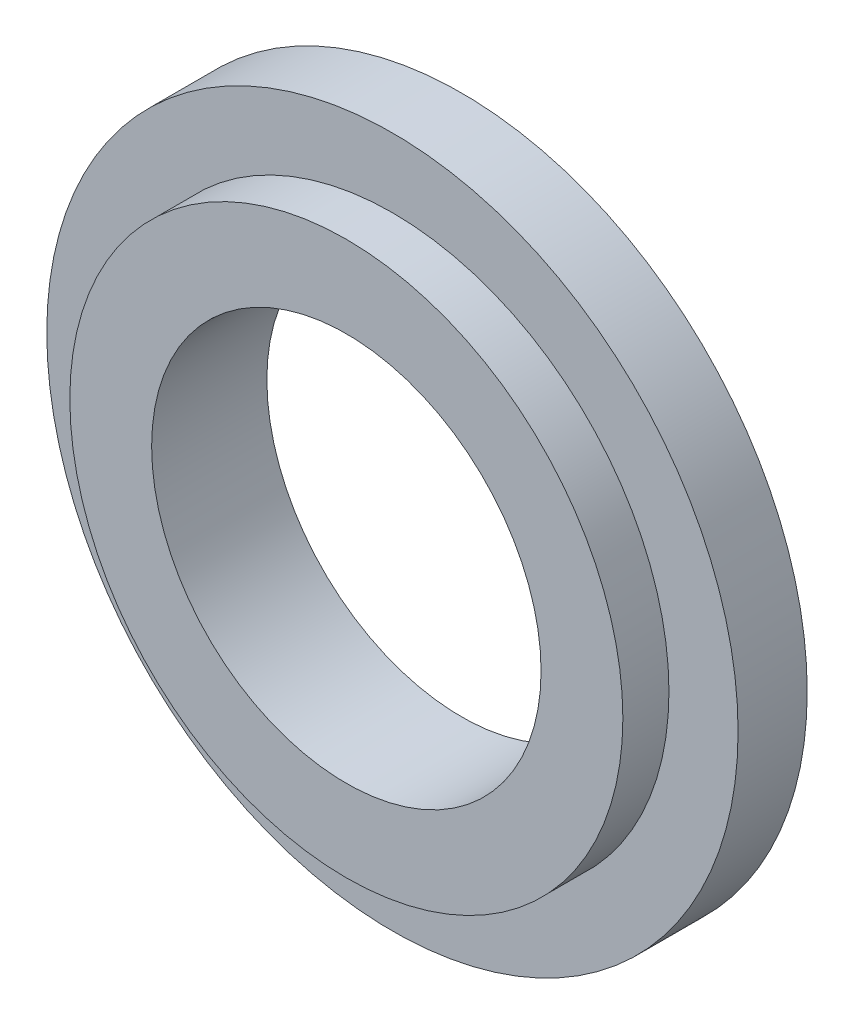
ISO-10303-21;
HEADER;
FILE_DESCRIPTION(('STEP AP214'),'2;1');
FILE_NAME('part.step','',(''),(''),'','','');
FILE_SCHEMA(('AUTOMOTIVE_DESIGN { 1 0 10303 214 1 1 1 1 }'));
ENDSEC;
DATA;
#1=APPLICATION_CONTEXT('core data for automotive mechanical design processes');
#2=APPLICATION_PROTOCOL_DEFINITION('international standard','automotive_design',2000,#1);
#3=PRODUCT_CONTEXT('',#1,'mechanical');
#4=PRODUCT('Part','Part','',(#3));
#5=PRODUCT_RELATED_PRODUCT_CATEGORY('part','',(#4));
#6=PRODUCT_DEFINITION_FORMATION('','',#4);
#7=PRODUCT_DEFINITION_CONTEXT('part definition',#1,'design');
#8=PRODUCT_DEFINITION('design','',#6,#7);
#9=PRODUCT_DEFINITION_SHAPE('','',#8);
#10=(LENGTH_UNIT() NAMED_UNIT(*) SI_UNIT(.MILLI.,.METRE.));
#11=(NAMED_UNIT(*) PLANE_ANGLE_UNIT() SI_UNIT($,.RADIAN.));
#12=(NAMED_UNIT(*) SI_UNIT($,.STERADIAN.) SOLID_ANGLE_UNIT());
#13=UNCERTAINTY_MEASURE_WITH_UNIT(LENGTH_MEASURE(1.E-05),#10,'distance_accuracy_value','');
#14=(GEOMETRIC_REPRESENTATION_CONTEXT(3) GLOBAL_UNCERTAINTY_ASSIGNED_CONTEXT((#13)) GLOBAL_UNIT_ASSIGNED_CONTEXT((#10,
#11,#12)) REPRESENTATION_CONTEXT('',''));
#15=CARTESIAN_POINT('',(0.,0.,0.));
#16=DIRECTION('',(0.,0.,1.));
#17=DIRECTION('',(1.,0.,0.));
#18=AXIS2_PLACEMENT_3D('',#15,#16,#17);
#19=CARTESIAN_POINT('',(0.,0.,3.));
#20=DIRECTION('',(0.,0.,1.));
#21=DIRECTION('',(1.,0.,0.));
#22=AXIS2_PLACEMENT_3D('',#19,#20,#21);
#23=PLANE('',#22);
#24=CARTESIAN_POINT('',(0.,0.,3.));
#25=DIRECTION('',(0.,0.,1.));
#26=DIRECTION('',(1.,0.,0.));
#27=AXIS2_PLACEMENT_3D('',#24,#25,#26);
#28=CIRCLE('',#27,15.);
#29=CARTESIAN_POINT('',(15.,0.,3.));
#30=VERTEX_POINT('',#29);
#31=EDGE_CURVE('E10',#30,#30,#28,.T.);
#32=ORIENTED_EDGE('',*,*,#31,.T.);
#33=EDGE_LOOP('',(#32));
#34=FACE_BOUND('',#33,.T.);
#35=CARTESIAN_POINT('',(0.,0.,3.));
#36=DIRECTION('',(0.,0.,1.));
#37=DIRECTION('',(1.,0.,0.));
#38=AXIS2_PLACEMENT_3D('',#35,#36,#37);
#39=CIRCLE('',#38,12.);
#40=CARTESIAN_POINT('',(12.,0.,3.));
#41=VERTEX_POINT('',#40);
#42=EDGE_CURVE('E44',#41,#41,#39,.T.);
#43=ORIENTED_EDGE('',*,*,#42,.F.);
#44=EDGE_LOOP('',(#43));
#45=FACE_BOUND('',#44,.T.);
#46=ADVANCED_FACE('F31',(#34,#45),#23,.T.);
#47=CARTESIAN_POINT('',(0.,0.,3.));
#48=DIRECTION('',(0.,0.,-1.));
#49=DIRECTION('',(-1.,0.,0.));
#50=AXIS2_PLACEMENT_3D('',#47,#48,#49);
#51=CYLINDRICAL_SURFACE('',#50,15.);
#52=ORIENTED_EDGE('',*,*,#31,.F.);
#53=EDGE_LOOP('',(#52));
#54=FACE_BOUND('',#53,.T.);
#55=CARTESIAN_POINT('',(0.,0.,0.));
#56=DIRECTION('',(0.,0.,1.));
#57=DIRECTION('',(1.,0.,0.));
#58=AXIS2_PLACEMENT_3D('',#55,#56,#57);
#59=CIRCLE('',#58,15.);
#60=CARTESIAN_POINT('',(15.,0.,0.));
#61=VERTEX_POINT('',#60);
#62=EDGE_CURVE('E35',#61,#61,#59,.T.);
#63=ORIENTED_EDGE('',*,*,#62,.T.);
#64=EDGE_LOOP('',(#63));
#65=FACE_BOUND('',#64,.T.);
#66=ADVANCED_FACE('F33',(#54,#65),#51,.T.);
#67=CARTESIAN_POINT('',(0.,0.,0.));
#68=DIRECTION('',(0.,0.,1.));
#69=DIRECTION('',(1.,0.,0.));
#70=AXIS2_PLACEMENT_3D('',#67,#68,#69);
#71=PLANE('',#70);
#72=CARTESIAN_POINT('',(0.,0.,0.));
#73=DIRECTION('',(0.,0.,1.));
#74=DIRECTION('',(1.,0.,0.));
#75=AXIS2_PLACEMENT_3D('',#72,#73,#74);
#76=CIRCLE('',#75,8.45);
#77=CARTESIAN_POINT('',(8.45,0.,0.));
#78=VERTEX_POINT('',#77);
#79=EDGE_CURVE('E47',#78,#78,#76,.T.);
#80=ORIENTED_EDGE('',*,*,#79,.T.);
#81=EDGE_LOOP('',(#80));
#82=FACE_BOUND('',#81,.T.);
#83=ORIENTED_EDGE('',*,*,#62,.F.);
#84=EDGE_LOOP('',(#83));
#85=FACE_BOUND('',#84,.T.);
#86=ADVANCED_FACE('F68',(#82,#85),#71,.F.);
#87=CARTESIAN_POINT('',(0.,0.,5.));
#88=DIRECTION('',(0.,0.,-1.));
#89=DIRECTION('',(-1.,0.,0.));
#90=AXIS2_PLACEMENT_3D('',#87,#88,#89);
#91=CYLINDRICAL_SURFACE('',#90,12.);
#92=CARTESIAN_POINT('',(0.,0.,5.));
#93=DIRECTION('',(0.,0.,1.));
#94=DIRECTION('',(1.,0.,0.));
#95=AXIS2_PLACEMENT_3D('',#92,#93,#94);
#96=CIRCLE('',#95,12.);
#97=CARTESIAN_POINT('',(12.,0.,5.));
#98=VERTEX_POINT('',#97);
#99=EDGE_CURVE('E42',#98,#98,#96,.T.);
#100=ORIENTED_EDGE('',*,*,#99,.F.);
#101=EDGE_LOOP('',(#100));
#102=FACE_BOUND('',#101,.T.);
#103=ORIENTED_EDGE('',*,*,#42,.T.);
#104=EDGE_LOOP('',(#103));
#105=FACE_BOUND('',#104,.T.);
#106=ADVANCED_FACE('F62',(#102,#105),#91,.T.);
#107=CARTESIAN_POINT('',(0.,0.,5.));
#108=DIRECTION('',(0.,0.,1.));
#109=DIRECTION('',(1.,0.,0.));
#110=AXIS2_PLACEMENT_3D('',#107,#108,#109);
#111=PLANE('',#110);
#112=CARTESIAN_POINT('',(0.,0.,5.));
#113=DIRECTION('',(0.,0.,1.));
#114=DIRECTION('',(1.,0.,0.));
#115=AXIS2_PLACEMENT_3D('',#112,#113,#114);
#116=CIRCLE('',#115,8.45);
#117=CARTESIAN_POINT('',(8.45,0.,5.));
#118=VERTEX_POINT('',#117);
#119=EDGE_CURVE('E52',#118,#118,#116,.T.);
#120=ORIENTED_EDGE('',*,*,#119,.F.);
#121=EDGE_LOOP('',(#120));
#122=FACE_BOUND('',#121,.T.);
#123=ORIENTED_EDGE('',*,*,#99,.T.);
#124=EDGE_LOOP('',(#123));
#125=FACE_BOUND('',#124,.T.);
#126=ADVANCED_FACE('F59',(#122,#125),#111,.T.);
#127=CARTESIAN_POINT('',(0.,0.,-8.));
#128=DIRECTION('',(0.,0.,1.));
#129=DIRECTION('',(1.,0.,0.));
#130=AXIS2_PLACEMENT_3D('',#127,#128,#129);
#131=CYLINDRICAL_SURFACE('',#130,8.45);
#132=ORIENTED_EDGE('',*,*,#119,.T.);
#133=EDGE_LOOP('',(#132));
#134=FACE_BOUND('',#133,.T.);
#135=ORIENTED_EDGE('',*,*,#79,.F.);
#136=EDGE_LOOP('',(#135));
#137=FACE_BOUND('',#136,.T.);
#138=ADVANCED_FACE('F56',(#134,#137),#131,.F.);
#139=CLOSED_SHELL('',(#46,#66,#86,#106,#126,#138));
#140=MANIFOLD_SOLID_BREP('B2',#139);
#141=ADVANCED_BREP_SHAPE_REPRESENTATION('',(#18,#140),#14);
#142=SHAPE_DEFINITION_REPRESENTATION(#9,#141);
ENDSEC;
END-ISO-10303-21;
